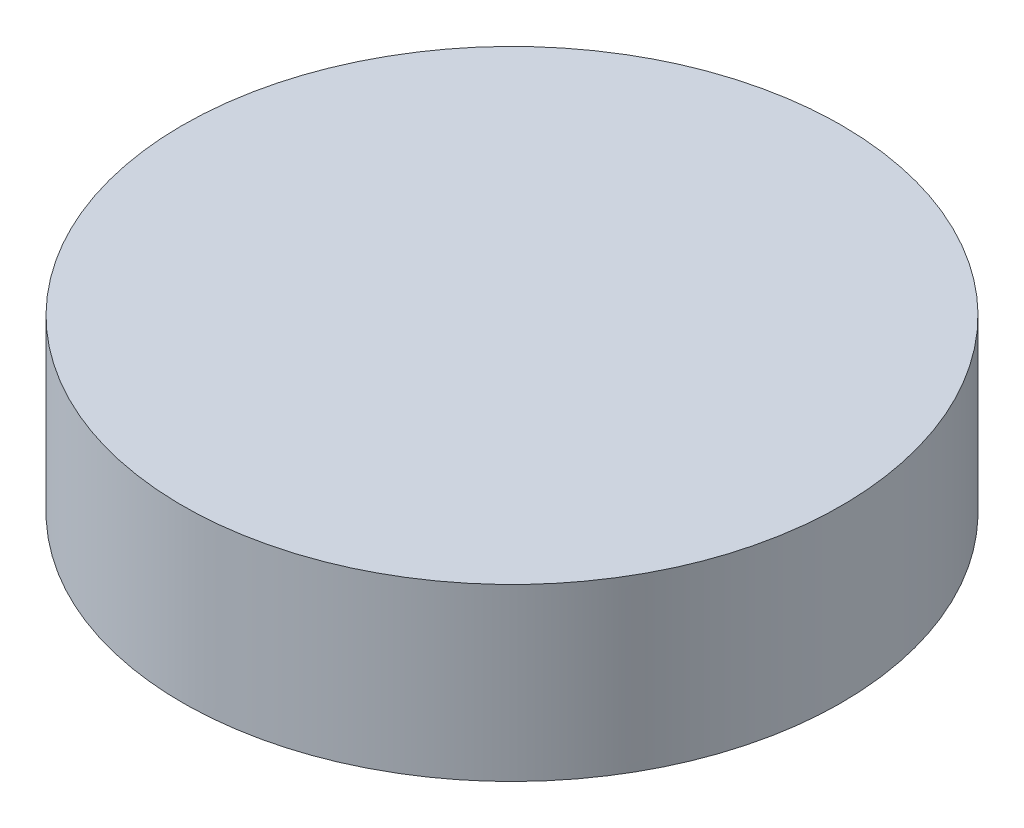
ISO-10303-21;
HEADER;
FILE_DESCRIPTION(('STEP AP214'),'2;1');
FILE_NAME('part.step','',(''),(''),'','','');
FILE_SCHEMA(('AUTOMOTIVE_DESIGN { 1 0 10303 214 1 1 1 1 }'));
ENDSEC;
DATA;
#1=APPLICATION_CONTEXT('core data for automotive mechanical design processes');
#2=APPLICATION_PROTOCOL_DEFINITION('international standard','automotive_design',2000,#1);
#3=PRODUCT_CONTEXT('',#1,'mechanical');
#4=PRODUCT('Part','Part','',(#3));
#5=PRODUCT_RELATED_PRODUCT_CATEGORY('part','',(#4));
#6=PRODUCT_DEFINITION_FORMATION('','',#4);
#7=PRODUCT_DEFINITION_CONTEXT('part definition',#1,'design');
#8=PRODUCT_DEFINITION('design','',#6,#7);
#9=PRODUCT_DEFINITION_SHAPE('','',#8);
#10=(LENGTH_UNIT() NAMED_UNIT(*) SI_UNIT(.MILLI.,.METRE.));
#11=(NAMED_UNIT(*) PLANE_ANGLE_UNIT() SI_UNIT($,.RADIAN.));
#12=(NAMED_UNIT(*) SI_UNIT($,.STERADIAN.) SOLID_ANGLE_UNIT());
#13=UNCERTAINTY_MEASURE_WITH_UNIT(LENGTH_MEASURE(1.E-05),#10,'distance_accuracy_value','');
#14=(GEOMETRIC_REPRESENTATION_CONTEXT(3) GLOBAL_UNCERTAINTY_ASSIGNED_CONTEXT((#13)) GLOBAL_UNIT_ASSIGNED_CONTEXT((#10,
#11,#12)) REPRESENTATION_CONTEXT('',''));
#15=CARTESIAN_POINT('',(0.,0.,0.));
#16=DIRECTION('',(0.,0.,1.));
#17=DIRECTION('',(1.,0.,0.));
#18=AXIS2_PLACEMENT_3D('',#15,#16,#17);
#19=CARTESIAN_POINT('',(-12.5,-8.1833687668426,-1.28535533905933));
#20=CARTESIAN_POINT('',(-12.3317700207924,-8.1833687668426,-1.28535533905933));
#21=CARTESIAN_POINT('',(-11.9953100623771,-8.1833687668426,-1.21842929220248));
#22=CARTESIAN_POINT('',(-11.5674545927316,-8.1833687668426,-0.932545407268426));
#23=CARTESIAN_POINT('',(-11.2815707077975,-8.1833687668426,-0.504689937622919));
#24=CARTESIAN_POINT('',(-11.1811816375122,-8.1833687668426,0.));
#25=CARTESIAN_POINT('',(-11.2815707077975,-8.1833687668426,0.504689937622919));
#26=CARTESIAN_POINT('',(-11.5674545927316,-8.1833687668426,0.932545407268426));
#27=CARTESIAN_POINT('',(-11.9953100623771,-8.1833687668426,1.21842929220248));
#28=CARTESIAN_POINT('',(-12.5,-8.1833687668426,1.31881836248775));
#29=CARTESIAN_POINT('',(-13.0046899376229,-8.1833687668426,1.21842929220248));
#30=CARTESIAN_POINT('',(-13.4325454072684,-8.1833687668426,0.932545407268426));
#31=CARTESIAN_POINT('',(-13.7184292922025,-8.1833687668426,0.50468993762292));
#32=CARTESIAN_POINT('',(-13.8188183624877,-8.1833687668426,0.));
#33=CARTESIAN_POINT('',(-13.7184292922025,-8.1833687668426,-0.504689937622919));
#34=CARTESIAN_POINT('',(-13.4325454072684,-8.1833687668426,-0.932545407268426));
#35=CARTESIAN_POINT('',(-13.0046899376229,-8.1833687668426,-1.21842929220248));
#36=CARTESIAN_POINT('',(-12.6682299792076,-8.1833687668426,-1.28535533905933));
#37=CARTESIAN_POINT('',(-12.5,-8.1833687668426,-1.28535533905933));
#38=B_SPLINE_CURVE_WITH_KNOTS('',3,(#19,#20,#21,#22,#23,#24,#25,#26,#27,#28,#29,#30,#31,#32,#33,
#34,#35,#36,#37),.UNSPECIFIED.,.T.,.F.,(4,1,1,1,1,1,1,1,1,1,1,1,1,1,1,1,4),(0.,
0.0625000000000001,0.125,0.1875,0.25,0.3125,0.375,0.4375,0.5,0.5625,0.625,0.6875,0.75,0.8125,
0.875,0.9375,1.),.UNSPECIFIED.);
#39=DIRECTION('',(0.,-1.,0.));
#40=VECTOR('',#39,1.);
#41=SURFACE_OF_LINEAR_EXTRUSION('',#38,#40);
#42=CARTESIAN_POINT('',(-12.5,-8.1833687668426,-1.28535533905933));
#43=CARTESIAN_POINT('',(-12.3317700207924,-8.1833687668426,-1.28535533905933));
#44=CARTESIAN_POINT('',(-11.9953100623771,-8.1833687668426,-1.21842929220248));
#45=CARTESIAN_POINT('',(-11.5674545927316,-8.1833687668426,-0.932545407268426));
#46=CARTESIAN_POINT('',(-11.2815707077975,-8.1833687668426,-0.504689937622919));
#47=CARTESIAN_POINT('',(-11.1811816375122,-8.1833687668426,0.));
#48=CARTESIAN_POINT('',(-11.2815707077975,-8.1833687668426,0.504689937622919));
#49=CARTESIAN_POINT('',(-11.5674545927316,-8.1833687668426,0.932545407268426));
#50=CARTESIAN_POINT('',(-11.9953100623771,-8.1833687668426,1.21842929220248));
#51=CARTESIAN_POINT('',(-12.5,-8.1833687668426,1.31881836248775));
#52=CARTESIAN_POINT('',(-13.0046899376229,-8.1833687668426,1.21842929220248));
#53=CARTESIAN_POINT('',(-13.4325454072684,-8.1833687668426,0.932545407268426));
#54=CARTESIAN_POINT('',(-13.7184292922025,-8.1833687668426,0.50468993762292));
#55=CARTESIAN_POINT('',(-13.8188183624877,-8.1833687668426,0.));
#56=CARTESIAN_POINT('',(-13.7184292922025,-8.1833687668426,-0.504689937622919));
#57=CARTESIAN_POINT('',(-13.4325454072684,-8.1833687668426,-0.932545407268426));
#58=CARTESIAN_POINT('',(-13.0046899376229,-8.1833687668426,-1.21842929220248));
#59=CARTESIAN_POINT('',(-12.6682299792076,-8.1833687668426,-1.28535533905933));
#60=CARTESIAN_POINT('',(-12.5,-8.1833687668426,-1.28535533905933));
#61=B_SPLINE_CURVE_WITH_KNOTS('',3,(#42,#43,#44,#45,#46,#47,#48,#49,#50,#51,#52,#53,#54,#55,#56,
#57,#58,#59,#60),.UNSPECIFIED.,.T.,.F.,(4,1,1,1,1,1,1,1,1,1,1,1,1,1,1,1,4),(0.,
0.0625000000000001,0.125,0.1875,0.25,0.3125,0.375,0.4375,0.5,0.5625,0.625,0.6875,0.75,0.8125,
0.875,0.9375,1.),.UNSPECIFIED.);
#62=CARTESIAN_POINT('',(-12.5,-8.1833687668426,-1.28535533905933));
#63=VERTEX_POINT('',#62);
#64=EDGE_CURVE('E9',#63,#63,#61,.T.);
#65=ORIENTED_EDGE('',*,*,#64,.T.);
#66=EDGE_LOOP('',(#65));
#67=FACE_BOUND('',#66,.T.);
#68=CARTESIAN_POINT('',(-12.5,-8.849,-1.28535533905933));
#69=CARTESIAN_POINT('',(-12.5210292435893,-8.849,-1.28535535428354));
#70=CARTESIAN_POINT('',(-12.5420580506909,-8.849,-1.2848324564651));
#71=CARTESIAN_POINT('',(-12.5840656469514,-8.849,-1.28275095206051));
#72=CARTESIAN_POINT('',(-12.605044433095,-8.849,-1.28119228454248));
#73=CARTESIAN_POINT('',(-12.6469017924796,-8.849,-1.27704921828212));
#74=CARTESIAN_POINT('',(-12.6677803587443,-8.849,-1.2744647491513));
#75=CARTESIAN_POINT('',(-12.7093873858979,-8.849,-1.26828002178174));
#76=CARTESIAN_POINT('',(-12.7301158402734,-8.849,-1.26467971973334));
#77=CARTESIAN_POINT('',(-12.7713726611837,-8.849,-1.25647322848943));
#78=CARTESIAN_POINT('',(-12.7919010277185,-8.849,-1.25186703929392));
#79=CARTESIAN_POINT('',(-12.832707709252,-8.849,-1.24165865806837));
#80=CARTESIAN_POINT('',(-12.8529860349978,-8.849,-1.23605650900607));
#81=CARTESIAN_POINT('',(-12.8932426430212,-8.849,-1.22386610104828));
#82=CARTESIAN_POINT('',(-12.9132209457939,-8.849,-1.21727790985115));
#83=CARTESIAN_POINT('',(-12.9528275830444,-8.849,-1.20312529881931));
#84=CARTESIAN_POINT('',(-12.9724559380415,-8.849,-1.19556093643833));
#85=CARTESIAN_POINT('',(-13.0113124478785,-8.849,-1.17946604308371));
#86=CARTESIAN_POINT('',(-13.0305406027184,-8.849,-1.17093551211008));
#87=CARTESIAN_POINT('',(-13.06855413176,-8.849,-1.15293679752466));
#88=CARTESIAN_POINT('',(-13.0873394798451,-8.849,-1.14346855877762));
#89=CARTESIAN_POINT('',(-13.1244251203754,-8.849,-1.12362275852903));
#90=CARTESIAN_POINT('',(-13.1427253794428,-8.849,-1.11324513466535));
#91=CARTESIAN_POINT('',(-13.1787984767248,-8.849,-1.09160886850265));
#92=CARTESIAN_POINT('',(-13.1965712921558,-8.849,-1.08035018822159));
#93=CARTESIAN_POINT('',(-13.2315471338735,-8.849,-1.05698007794264));
#94=CARTESIAN_POINT('',(-13.2487501601601,-8.849,-1.04486864794475));
#95=CARTESIAN_POINT('',(-13.2825440403118,-8.849,-1.0198212922901));
#96=CARTESIAN_POINT('',(-13.2991349205488,-8.849,-1.00688540221767));
#97=CARTESIAN_POINT('',(-13.331662109414,-8.849,-0.980217396939715));
#98=CARTESIAN_POINT('',(-13.3475984628843,-8.849,-0.966485336436221));
#99=CARTESIAN_POINT('',(-13.3787742546724,-8.849,-0.938253224868504));
#100=CARTESIAN_POINT('',(-13.3940137339342,-8.849,-0.923753219032213));
#101=CARTESIAN_POINT('',(-13.4237532190322,-8.849,-0.894013733934155));
#102=CARTESIAN_POINT('',(-13.4382532248685,-8.849,-0.878774254672389));
#103=CARTESIAN_POINT('',(-13.4664853364362,-8.849,-0.847598462884291));
#104=CARTESIAN_POINT('',(-13.4802173969397,-8.849,-0.831662109414029));
#105=CARTESIAN_POINT('',(-13.5068854022177,-8.849,-0.799134920548772));
#106=CARTESIAN_POINT('',(-13.5198212922901,-8.849,-0.782544040311809));
#107=CARTESIAN_POINT('',(-13.5448686479447,-8.849,-0.748750160160128));
#108=CARTESIAN_POINT('',(-13.5569800779426,-8.849,-0.731547133873459));
#109=CARTESIAN_POINT('',(-13.5803501882216,-8.849,-0.696571292155848));
#110=CARTESIAN_POINT('',(-13.5916088685027,-8.849,-0.678798476724906));
#111=CARTESIAN_POINT('',(-13.6132451346653,-8.849,-0.642725379442669));
#112=CARTESIAN_POINT('',(-13.623622758529,-8.849,-0.624425120374889));
#113=CARTESIAN_POINT('',(-13.6434685587776,-8.849,-0.587339479845542));
#114=CARTESIAN_POINT('',(-13.6529367975248,-8.849,-0.568554131761774));
#115=CARTESIAN_POINT('',(-13.67093551211,-8.849,-0.530540602716617));
#116=CARTESIAN_POINT('',(-13.6794660430833,-8.849,-0.511312447871825));
#117=CARTESIAN_POINT('',(-13.6955609364387,-8.849,-0.472455938048209));
#118=CARTESIAN_POINT('',(-13.7031252988208,-8.849,-0.452827583069387));
#119=CARTESIAN_POINT('',(-13.7172779098496,-8.849,-0.413220945768882));
#120=CARTESIAN_POINT('',(-13.7238661010426,-8.849,-0.39324264292792));
#121=CARTESIAN_POINT('',(-13.7360565090117,-8.849,-0.352986035091083));
#122=CARTESIAN_POINT('',(-13.7416586580894,-8.849,-0.332707709600189));
#123=CARTESIAN_POINT('',(-13.7518670392729,-8.849,-0.291901027370323));
#124=CARTESIAN_POINT('',(-13.7564732284109,-8.849,-0.271372659884375));
#125=CARTESIAN_POINT('',(-13.7646797198118,-8.849,-0.230115841572818));
#126=CARTESIAN_POINT('',(-13.7682800220747,-8.849,-0.209387390747211));
#127=CARTESIAN_POINT('',(-13.7744647488584,-8.849,-0.167780353895161));
#128=CARTESIAN_POINT('',(-13.7770492171889,-8.849,-0.146901774382847));
#129=CARTESIAN_POINT('',(-13.7811922856357,-8.849,-0.10504445119053));
#130=CARTESIAN_POINT('',(-13.7827509561402,-8.849,-0.0840657144826372));
#131=CARTESIAN_POINT('',(-13.7848324523857,-8.849,-0.0420579831636655));
#132=CARTESIAN_POINT('',(-13.7853553390593,-8.849,-0.0210289915818326));
#133=CARTESIAN_POINT('',(-13.7853553390593,-8.849,0.0210289915818331));
#134=CARTESIAN_POINT('',(-13.7848324523857,-8.849,0.0420579831636659));
#135=CARTESIAN_POINT('',(-13.7827509561402,-8.849,0.0840657144826377));
#136=CARTESIAN_POINT('',(-13.7811922856357,-8.849,0.10504445119053));
#137=CARTESIAN_POINT('',(-13.7770492171889,-8.849,0.146901774382848));
#138=CARTESIAN_POINT('',(-13.7744647488584,-8.849,0.167780353895162));
#139=CARTESIAN_POINT('',(-13.7682800220747,-8.849,0.209387390747211));
#140=CARTESIAN_POINT('',(-13.7646797198118,-8.849,0.230115841572819));
#141=CARTESIAN_POINT('',(-13.7564732284109,-8.849,0.271372659884376));
#142=CARTESIAN_POINT('',(-13.7518670392729,-8.849,0.291901027370324));
#143=CARTESIAN_POINT('',(-13.7416586580894,-8.849,0.33270770960019));
#144=CARTESIAN_POINT('',(-13.7360565090117,-8.849,0.352986035091084));
#145=CARTESIAN_POINT('',(-13.7238661010426,-8.849,0.393242642927921));
#146=CARTESIAN_POINT('',(-13.7172779098496,-8.849,0.413220945768883));
#147=CARTESIAN_POINT('',(-13.7031252988208,-8.849,0.452827583069388));
#148=CARTESIAN_POINT('',(-13.6955609364387,-8.849,0.472455938048211));
#149=CARTESIAN_POINT('',(-13.6794660430833,-8.849,0.511312447871826));
#150=CARTESIAN_POINT('',(-13.67093551211,-8.849,0.530540602716618));
#151=CARTESIAN_POINT('',(-13.6529367975248,-8.849,0.568554131761775));
#152=CARTESIAN_POINT('',(-13.6434685587776,-8.849,0.587339479845544));
#153=CARTESIAN_POINT('',(-13.623622758529,-8.849,0.624425120374891));
#154=CARTESIAN_POINT('',(-13.6132451346653,-8.849,0.64272537944267));
#155=CARTESIAN_POINT('',(-13.5916088685027,-8.849,0.678798476724906));
#156=CARTESIAN_POINT('',(-13.5803501882216,-8.849,0.69657129215585));
#157=CARTESIAN_POINT('',(-13.5569800779426,-8.849,0.731547133873461));
#158=CARTESIAN_POINT('',(-13.5448686479447,-8.849,0.748750160160129));
#159=CARTESIAN_POINT('',(-13.5198212922901,-8.849,0.78254404031181));
#160=CARTESIAN_POINT('',(-13.5068854022177,-8.849,0.799134920548773));
#161=CARTESIAN_POINT('',(-13.4802173969397,-8.849,0.83166210941403));
#162=CARTESIAN_POINT('',(-13.4664853364362,-8.849,0.847598462884291));
#163=CARTESIAN_POINT('',(-13.4382532248685,-8.849,0.87877425467239));
#164=CARTESIAN_POINT('',(-13.4237532190322,-8.849,0.894013733934156));
#165=CARTESIAN_POINT('',(-13.3940137339342,-8.849,0.923753219032213));
#166=CARTESIAN_POINT('',(-13.3787742546724,-8.849,0.938253224868505));
#167=CARTESIAN_POINT('',(-13.3475984628843,-8.849,0.966485336436221));
#168=CARTESIAN_POINT('',(-13.331662109414,-8.849,0.980217396939716));
#169=CARTESIAN_POINT('',(-13.2991349205488,-8.849,1.00688540221767));
#170=CARTESIAN_POINT('',(-13.2825440403118,-8.849,1.0198212922901));
#171=CARTESIAN_POINT('',(-13.2487501601601,-8.849,1.04486864794475));
#172=CARTESIAN_POINT('',(-13.2315471338735,-8.849,1.05698007794264));
#173=CARTESIAN_POINT('',(-13.1965712921558,-8.849,1.08035018822159));
#174=CARTESIAN_POINT('',(-13.1787984767249,-8.849,1.09160886850266));
#175=CARTESIAN_POINT('',(-13.1427253794427,-8.849,1.11324513466535));
#176=CARTESIAN_POINT('',(-13.1244251203749,-8.849,1.12362275852901));
#177=CARTESIAN_POINT('',(-13.0873394798455,-8.849,1.14346855877765));
#178=CARTESIAN_POINT('',(-13.0685541317618,-8.849,1.15293679752477));
#179=CARTESIAN_POINT('',(-13.0305406027166,-8.849,1.17093551210997));
#180=CARTESIAN_POINT('',(-13.0113124478718,-8.849,1.17946604308331));
#181=CARTESIAN_POINT('',(-12.9724559380482,-8.849,1.19556093643873));
#182=CARTESIAN_POINT('',(-12.9528275830694,-8.849,1.20312529882082));
#183=CARTESIAN_POINT('',(-12.9132209457689,-8.849,1.21727790984964));
#184=CARTESIAN_POINT('',(-12.8932426429279,-8.849,1.22386610104265));
#185=CARTESIAN_POINT('',(-12.8529860350911,-8.849,1.23605650901171));
#186=CARTESIAN_POINT('',(-12.8327077096002,-8.849,1.24165865808941));
#187=CARTESIAN_POINT('',(-12.7919010273703,-8.849,1.25186703927288));
#188=CARTESIAN_POINT('',(-12.7713726598844,-8.849,1.25647322841093));
#189=CARTESIAN_POINT('',(-12.7301158415728,-8.849,1.26467971981183));
#190=CARTESIAN_POINT('',(-12.7093873907472,-8.849,1.26828002207469));
#191=CARTESIAN_POINT('',(-12.6677803538952,-8.849,1.27446474885836));
#192=CARTESIAN_POINT('',(-12.6469017743828,-8.849,1.27704921718887));
#193=CARTESIAN_POINT('',(-12.6050444511905,-8.849,1.28119228563567));
#194=CARTESIAN_POINT('',(-12.5840657144826,-8.849,1.28275095614019));
#195=CARTESIAN_POINT('',(-12.5420579831637,-8.849,1.28483245238567));
#196=CARTESIAN_POINT('',(-12.5210289915818,-8.849,1.28535533905933));
#197=CARTESIAN_POINT('',(-12.4789710084182,-8.849,1.28535533905933));
#198=CARTESIAN_POINT('',(-12.4579420168363,-8.849,1.28483245238567));
#199=CARTESIAN_POINT('',(-12.4159342855174,-8.849,1.28275095614019));
#200=CARTESIAN_POINT('',(-12.3949555488095,-8.849,1.28119228563567));
#201=CARTESIAN_POINT('',(-12.3530982256172,-8.849,1.27704921718887));
#202=CARTESIAN_POINT('',(-12.3322196461048,-8.849,1.27446474885836));
#203=CARTESIAN_POINT('',(-12.2906126092528,-8.849,1.26828002207469));
#204=CARTESIAN_POINT('',(-12.2698841584272,-8.849,1.26467971981183));
#205=CARTESIAN_POINT('',(-12.2286273401156,-8.849,1.25647322841093));
#206=CARTESIAN_POINT('',(-12.2080989726297,-8.849,1.25186703927288));
#207=CARTESIAN_POINT('',(-12.1672922903998,-8.849,1.24165865808941));
#208=CARTESIAN_POINT('',(-12.1470139649089,-8.849,1.23605650901171));
#209=CARTESIAN_POINT('',(-12.1067573570721,-8.849,1.22386610104265));
#210=CARTESIAN_POINT('',(-12.0867790542311,-8.849,1.21727790984964));
#211=CARTESIAN_POINT('',(-12.0471724169306,-8.849,1.20312529882082));
#212=CARTESIAN_POINT('',(-12.0275440619518,-8.849,1.19556093643873));
#213=CARTESIAN_POINT('',(-11.9886875521282,-8.849,1.17946604308331));
#214=CARTESIAN_POINT('',(-11.9694593972834,-8.849,1.17093551210997));
#215=CARTESIAN_POINT('',(-11.9314458682382,-8.849,1.15293679752477));
#216=CARTESIAN_POINT('',(-11.9126605201545,-8.849,1.14346855877765));
#217=CARTESIAN_POINT('',(-11.8755748796251,-8.849,1.123622758529));
#218=CARTESIAN_POINT('',(-11.8572746205573,-8.849,1.11324513466535));
#219=CARTESIAN_POINT('',(-11.8212015232751,-8.849,1.09160886850266));
#220=CARTESIAN_POINT('',(-11.8034287078441,-8.849,1.08035018822159));
#221=CARTESIAN_POINT('',(-11.7684528661265,-8.849,1.05698007794264));
#222=CARTESIAN_POINT('',(-11.7512498398399,-8.849,1.04486864794475));
#223=CARTESIAN_POINT('',(-11.7174559596882,-8.849,1.0198212922901));
#224=CARTESIAN_POINT('',(-11.7008650794512,-8.849,1.00688540221767));
#225=CARTESIAN_POINT('',(-11.668337890586,-8.849,0.980217396939715));
#226=CARTESIAN_POINT('',(-11.6524015371157,-8.849,0.966485336436221));
#227=CARTESIAN_POINT('',(-11.6212257453276,-8.849,0.938253224868504));
#228=CARTESIAN_POINT('',(-11.6059862660658,-8.849,0.923753219032213));
#229=CARTESIAN_POINT('',(-11.5762467809678,-8.849,0.894013733934155));
#230=CARTESIAN_POINT('',(-11.5617467751315,-8.849,0.878774254672389));
#231=CARTESIAN_POINT('',(-11.5335146635638,-8.849,0.84759846288429));
#232=CARTESIAN_POINT('',(-11.5197826030603,-8.849,0.831662109414029));
#233=CARTESIAN_POINT('',(-11.4931145977823,-8.849,0.799134920548772));
#234=CARTESIAN_POINT('',(-11.4801787077099,-8.849,0.782544040311809));
#235=CARTESIAN_POINT('',(-11.4551313520553,-8.849,0.748750160160128));
#236=CARTESIAN_POINT('',(-11.4430199220574,-8.849,0.73154713387346));
#237=CARTESIAN_POINT('',(-11.4196498117784,-8.849,0.696571292155849));
#238=CARTESIAN_POINT('',(-11.4083911314973,-8.849,0.678798476724905));
#239=CARTESIAN_POINT('',(-11.3867548653347,-8.849,0.642725379442669));
#240=CARTESIAN_POINT('',(-11.376377241471,-8.849,0.62442512037489));
#241=CARTESIAN_POINT('',(-11.3565314412223,-8.849,0.587339479845543));
#242=CARTESIAN_POINT('',(-11.3470632024752,-8.849,0.568554131761774));
#243=CARTESIAN_POINT('',(-11.32906448789,-8.849,0.530540602716617));
#244=CARTESIAN_POINT('',(-11.3205339569167,-8.849,0.511312447871824));
#245=CARTESIAN_POINT('',(-11.3044390635613,-8.849,0.472455938048209));
#246=CARTESIAN_POINT('',(-11.2968747011792,-8.849,0.452827583069387));
#247=CARTESIAN_POINT('',(-11.2827220901504,-8.849,0.413220945768882));
#248=CARTESIAN_POINT('',(-11.2761338989574,-8.849,0.39324264292792));
#249=CARTESIAN_POINT('',(-11.2639434909883,-8.849,0.352986035091083));
#250=CARTESIAN_POINT('',(-11.2583413419106,-8.849,0.332707709600189));
#251=CARTESIAN_POINT('',(-11.2481329607271,-8.849,0.291901027370323));
#252=CARTESIAN_POINT('',(-11.2435267715891,-8.849,0.271372659884375));
#253=CARTESIAN_POINT('',(-11.2353202801882,-8.849,0.230115841572818));
#254=CARTESIAN_POINT('',(-11.2317199779253,-8.849,0.209387390747211));
#255=CARTESIAN_POINT('',(-11.2255352511416,-8.849,0.167780353895161));
#256=CARTESIAN_POINT('',(-11.2229507828111,-8.849,0.146901774382847));
#257=CARTESIAN_POINT('',(-11.2188077143643,-8.849,0.105044451190529));
#258=CARTESIAN_POINT('',(-11.2172490438598,-8.849,0.0840657144826369));
#259=CARTESIAN_POINT('',(-11.2151675476143,-8.849,0.0420579831636654));
#260=CARTESIAN_POINT('',(-11.2146446609407,-8.849,0.0210289915818325));
#261=CARTESIAN_POINT('',(-11.2146446609407,-8.849,-0.0210289915818333));
#262=CARTESIAN_POINT('',(-11.2151675476143,-8.849,-0.0420579831636662));
#263=CARTESIAN_POINT('',(-11.2172490438598,-8.849,-0.0840657144826378));
#264=CARTESIAN_POINT('',(-11.2188077143643,-8.849,-0.10504445119053));
#265=CARTESIAN_POINT('',(-11.2229507828111,-8.849,-0.146901774382848));
#266=CARTESIAN_POINT('',(-11.2255352511416,-8.849,-0.167780353895162));
#267=CARTESIAN_POINT('',(-11.2317199779253,-8.849,-0.209387390747211));
#268=CARTESIAN_POINT('',(-11.2353202801882,-8.849,-0.230115841572819));
#269=CARTESIAN_POINT('',(-11.2435267715891,-8.849,-0.271372659884375));
#270=CARTESIAN_POINT('',(-11.2481329607271,-8.849,-0.291901027370323));
#271=CARTESIAN_POINT('',(-11.2583413419106,-8.849,-0.33270770960019));
#272=CARTESIAN_POINT('',(-11.2639434909883,-8.849,-0.352986035091083));
#273=CARTESIAN_POINT('',(-11.2761338989574,-8.849,-0.393242642927921));
#274=CARTESIAN_POINT('',(-11.2827220901504,-8.849,-0.413220945768883));
#275=CARTESIAN_POINT('',(-11.2968747011792,-8.849,-0.452827583069388));
#276=CARTESIAN_POINT('',(-11.3044390635613,-8.849,-0.47245593804821));
#277=CARTESIAN_POINT('',(-11.3205339569167,-8.849,-0.511312447871825));
#278=CARTESIAN_POINT('',(-11.32906448789,-8.849,-0.530540602716618));
#279=CARTESIAN_POINT('',(-11.3470632024752,-8.849,-0.568554131761775));
#280=CARTESIAN_POINT('',(-11.3565314412223,-8.849,-0.587339479845543));
#281=CARTESIAN_POINT('',(-11.376377241471,-8.849,-0.62442512037489));
#282=CARTESIAN_POINT('',(-11.3867548653347,-8.849,-0.642725379442669));
#283=CARTESIAN_POINT('',(-11.4083911314973,-8.849,-0.678798476724906));
#284=CARTESIAN_POINT('',(-11.4196498117784,-8.849,-0.696571292155849));
#285=CARTESIAN_POINT('',(-11.4430199220574,-8.849,-0.73154713387346));
#286=CARTESIAN_POINT('',(-11.4551313520553,-8.849,-0.748750160160128));
#287=CARTESIAN_POINT('',(-11.4801787077099,-8.849,-0.782544040311809));
#288=CARTESIAN_POINT('',(-11.4931145977823,-8.849,-0.799134920548772));
#289=CARTESIAN_POINT('',(-11.5197826030603,-8.849,-0.831662109414029));
#290=CARTESIAN_POINT('',(-11.5335146635638,-8.849,-0.847598462884291));
#291=CARTESIAN_POINT('',(-11.5617467751315,-8.849,-0.878774254672389));
#292=CARTESIAN_POINT('',(-11.5762467809678,-8.849,-0.894013733934155));
#293=CARTESIAN_POINT('',(-11.6059862660658,-8.849,-0.923753219032213));
#294=CARTESIAN_POINT('',(-11.6212257453276,-8.849,-0.938253224868505));
#295=CARTESIAN_POINT('',(-11.6524015371157,-8.849,-0.966485336436221));
#296=CARTESIAN_POINT('',(-11.668337890586,-8.849,-0.980217396939716));
#297=CARTESIAN_POINT('',(-11.7008650794512,-8.849,-1.00688540221767));
#298=CARTESIAN_POINT('',(-11.7174559596882,-8.849,-1.0198212922901));
#299=CARTESIAN_POINT('',(-11.7512498398399,-8.849,-1.04486864794475));
#300=CARTESIAN_POINT('',(-11.7684528661265,-8.849,-1.05698007794264));
#301=CARTESIAN_POINT('',(-11.8034287078442,-8.849,-1.08035018822159));
#302=CARTESIAN_POINT('',(-11.8212015232752,-8.849,-1.09160886850265));
#303=CARTESIAN_POINT('',(-11.8572746205572,-8.849,-1.11324513466535));
#304=CARTESIAN_POINT('',(-11.8755748796246,-8.849,-1.12362275852903));
#305=CARTESIAN_POINT('',(-11.9126605201549,-8.849,-1.14346855877762));
#306=CARTESIAN_POINT('',(-11.93144586824,-8.849,-1.15293679752466));
#307=CARTESIAN_POINT('',(-11.9694593972816,-8.849,-1.17093551211008));
#308=CARTESIAN_POINT('',(-11.9886875521215,-8.849,-1.17946604308371));
#309=CARTESIAN_POINT('',(-12.0275440619585,-8.849,-1.19556093643833));
#310=CARTESIAN_POINT('',(-12.0471724169556,-8.849,-1.20312529881931));
#311=CARTESIAN_POINT('',(-12.0867790542061,-8.849,-1.21727790985115));
#312=CARTESIAN_POINT('',(-12.1067573569788,-8.849,-1.22386610104828));
#313=CARTESIAN_POINT('',(-12.1470139650022,-8.849,-1.23605650900607));
#314=CARTESIAN_POINT('',(-12.167292290748,-8.849,-1.24165865806837));
#315=CARTESIAN_POINT('',(-12.2080989722815,-8.849,-1.25186703929392));
#316=CARTESIAN_POINT('',(-12.2286273388163,-8.849,-1.25647322848943));
#317=CARTESIAN_POINT('',(-12.2698841597265,-8.849,-1.26467971973334));
#318=CARTESIAN_POINT('',(-12.2906126141021,-8.849,-1.26828002178174));
#319=CARTESIAN_POINT('',(-12.3322196412557,-8.849,-1.2744647491513));
#320=CARTESIAN_POINT('',(-12.3530982075204,-8.849,-1.27704921828212));
#321=CARTESIAN_POINT('',(-12.394955566905,-8.849,-1.28119228454249));
#322=CARTESIAN_POINT('',(-12.4159343530485,-8.849,-1.28275095206051));
#323=CARTESIAN_POINT('',(-12.4579419493091,-8.849,-1.2848324564651));
#324=CARTESIAN_POINT('',(-12.4789707564107,-8.849,-1.28535535428354));
#325=CARTESIAN_POINT('',(-12.5,-8.849,-1.28535533905933));
#326=B_SPLINE_CURVE_WITH_KNOTS('',3,(#68,#69,#70,#71,#72,#73,#74,#75,#76,#77,#78,#79,#80,#81,
#82,#83,#84,#85,#86,#87,#88,#89,#90,#91,#92,#93,#94,#95,#96,#97,#98,#99,#100,#101,#102,#103,
#104,#105,#106,#107,#108,#109,#110,#111,#112,#113,#114,#115,#116,#117,#118,#119,#120,#121,#122,
#123,#124,#125,#126,#127,#128,#129,#130,#131,#132,#133,#134,#135,#136,#137,#138,#139,#140,#141,
#142,#143,#144,#145,#146,#147,#148,#149,#150,#151,#152,#153,#154,#155,#156,#157,#158,#159,#160,
#161,#162,#163,#164,#165,#166,#167,#168,#169,#170,#171,#172,#173,#174,#175,#176,#177,#178,#179,
#180,#181,#182,#183,#184,#185,#186,#187,#188,#189,#190,#191,#192,#193,#194,#195,#196,#197,#198,
#199,#200,#201,#202,#203,#204,#205,#206,#207,#208,#209,#210,#211,#212,#213,#214,#215,#216,#217,
#218,#219,#220,#221,#222,#223,#224,#225,#226,#227,#228,#229,#230,#231,#232,#233,#234,#235,#236,
#237,#238,#239,#240,#241,#242,#243,#244,#245,#246,#247,#248,#249,#250,#251,#252,#253,#254,#255,
#256,#257,#258,#259,#260,#261,#262,#263,#264,#265,#266,#267,#268,#269,#270,#271,#272,#273,#274,
#275,#276,#277,#278,#279,#280,#281,#282,#283,#284,#285,#286,#287,#288,#289,#290,#291,#292,#293,
#294,#295,#296,#297,#298,#299,#300,#301,#302,#303,#304,#305,#306,#307,#308,#309,#310,#311,#312,
#313,#314,#315,#316,#317,#318,#319,#320,#321,#322,#323,#324,#325),.UNSPECIFIED.,.F.,.F.,(4,2,2,
2,2,2,2,2,2,2,2,2,2,2,2,2,2,2,2,2,2,2,2,2,2,2,2,2,2,2,2,2,2,2,2,2,2,2,2,2,2,2,2,2,2,2,2,2,2,2,2,
2,2,2,2,2,2,2,2,2,2,2,2,2,2,2,2,2,2,2,2,2,2,2,2,2,2,2,2,2,2,2,2,2,2,2,2,2,2,2,2,2,2,2,2,2,2,2,2,
2,2,2,2,2,2,2,2,2,2,2,2,2,2,2,2,2,2,2,2,2,2,2,2,2,2,2,2,2,4),(0.,0.0630806127990758,
0.12616493680959,0.189253590290848,0.252344965001654,0.315436339712461,0.378524993193721,
0.441609317204232,0.504689930003312,0.567770542802388,0.6308548668129,0.693943520294158,
0.757034895004962,0.82012626971577,0.883214923197029,0.946299247207541,1.00937986000662,
1.0724604728057,1.13554479681621,1.19863345029747,1.26172482500827,1.32481619971908,
1.38790485320034,1.45098917721085,1.51406979000993,1.57715040280901,1.64023472681952,
1.70332338030078,1.76641475501158,1.82950612972239,1.89259478320365,1.95567910721416,
2.01875972001324,2.08184033281232,2.14492465682283,2.20801331030409,2.27110468501489,
2.3341960597257,2.39728471320696,2.46036903721747,2.52344965001655,2.58653026281563,
2.64961458682614,2.7127032403074,2.7757946150182,2.83888598972901,2.90197464321027,
2.96505896722078,3.02813958001986,3.09122019281893,3.15430451682944,3.2173931703107,
3.28048454502151,3.34357591973231,3.40666457321357,3.46974889722409,3.53282951002316,
3.59591012282224,3.65899444683275,3.72208310031401,3.78517447502482,3.84826584973563,
3.91135450321688,3.9744388272274,4.03751944002647,4.10060005282555,4.16368437683606,
4.22677303031732,4.28986440502813,4.35295577973894,4.4160444332202,4.47912875723071,
4.54220937002979,4.60528998282887,4.66837430683938,4.73146296032063,4.79455433503144,
4.85764570974225,4.9207343632235,4.98381868723402,5.04689930003309,5.10997991283217,
5.17306423684268,5.23615289032394,5.29924426503475,5.36233563974555,5.42542429322681,
5.48850861723732,5.5515892300364,5.61466984283548,5.67775416684599,5.74084282032725,
5.80393419503806,5.86702556974886,5.93011422323012,5.99319854724063,6.05627916003971,
6.11935977283879,6.1824440968493,6.24553275033056,6.30862412504136,6.37171549975217,
6.43480415323343,6.49788847724394,6.56096909004302,6.6240497028421,6.68713402685261,
6.75022268033387,6.81331405504467,6.87640542975548,6.93949408323674,7.00257840724725,
7.06565902004633,7.12873963284541,7.19182395685592,7.25491261033718,7.31800398504799,
7.38109535975879,7.44418401324005,7.50726833725056,7.57034895004964,7.63342956284872,
7.69651388685923,7.75960254034049,7.82269391505129,7.8857852897621,7.94887394324336,
8.01195826725387,8.07503888005295),.UNSPECIFIED.);
#327=CARTESIAN_POINT('',(-12.5,-8.849,-1.28535533905933));
#328=VERTEX_POINT('',#327);
#329=EDGE_CURVE('E24',#328,#328,#326,.F.);
#330=ORIENTED_EDGE('',*,*,#329,.F.);
#331=EDGE_LOOP('',(#330));
#332=FACE_BOUND('',#331,.T.);
#333=ADVANCED_FACE('F14',(#67,#332),#41,.T.);
#334=CARTESIAN_POINT('',(-11.25,-8.1833687668426,0.));
#335=DIRECTION('',(0.,-1.,0.));
#336=DIRECTION('',(1.,0.,0.));
#337=AXIS2_PLACEMENT_3D('',#334,#335,#336);
#338=PLANE('',#337);
#339=ORIENTED_EDGE('',*,*,#64,.F.);
#340=EDGE_LOOP('',(#339));
#341=FACE_BOUND('',#340,.T.);
#342=ADVANCED_FACE('F62',(#341),#338,.F.);
#343=CARTESIAN_POINT('',(-11.25,-8.849,0.));
#344=DIRECTION('',(0.,-1.,0.));
#345=DIRECTION('',(1.,0.,0.));
#346=AXIS2_PLACEMENT_3D('',#343,#344,#345);
#347=PLANE('',#346);
#348=ORIENTED_EDGE('',*,*,#329,.T.);
#349=EDGE_LOOP('',(#348));
#350=FACE_BOUND('',#349,.T.);
#351=ADVANCED_FACE('F31',(#350),#347,.T.);
#352=CLOSED_SHELL('',(#333,#342,#351));
#353=MANIFOLD_SOLID_BREP('B1',#352);
#354=ADVANCED_BREP_SHAPE_REPRESENTATION('',(#18,#353),#14);
#355=SHAPE_DEFINITION_REPRESENTATION(#9,#354);
ENDSEC;
END-ISO-10303-21;
